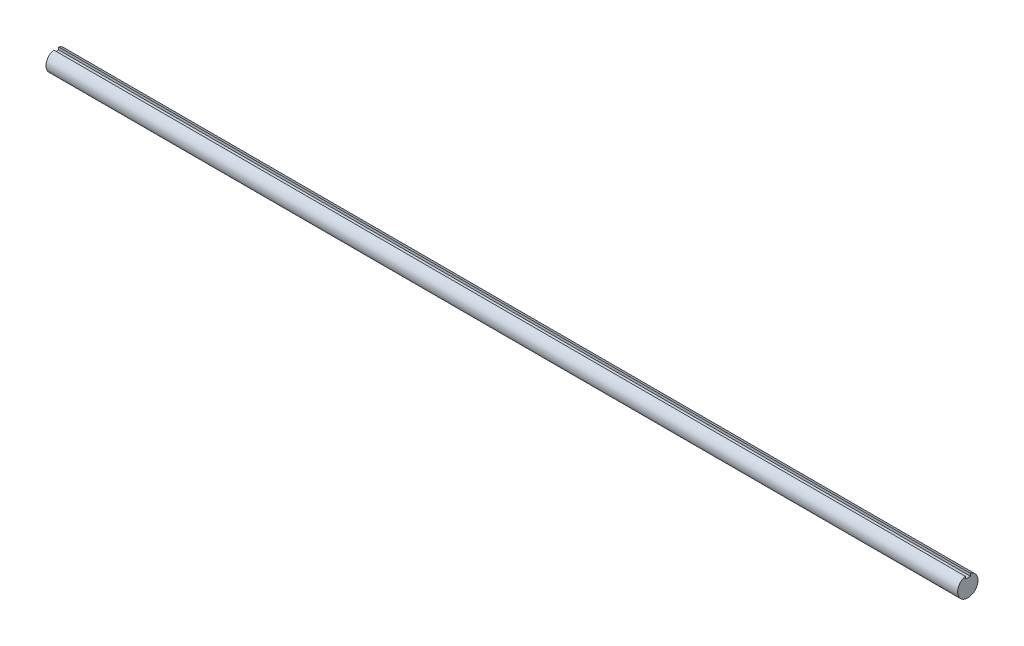
ISO-10303-21;
HEADER;
FILE_DESCRIPTION(('STEP AP214'),'2;1');
FILE_NAME('part.step','',(''),(''),'','','');
FILE_SCHEMA(('AUTOMOTIVE_DESIGN { 1 0 10303 214 1 1 1 1 }'));
ENDSEC;
DATA;
#1=APPLICATION_CONTEXT('core data for automotive mechanical design processes');
#2=APPLICATION_PROTOCOL_DEFINITION('international standard','automotive_design',2000,#1);
#3=PRODUCT_CONTEXT('',#1,'mechanical');
#4=PRODUCT('Part','Part','',(#3));
#5=PRODUCT_RELATED_PRODUCT_CATEGORY('part','',(#4));
#6=PRODUCT_DEFINITION_FORMATION('','',#4);
#7=PRODUCT_DEFINITION_CONTEXT('part definition',#1,'design');
#8=PRODUCT_DEFINITION('design','',#6,#7);
#9=PRODUCT_DEFINITION_SHAPE('','',#8);
#10=(LENGTH_UNIT() NAMED_UNIT(*) SI_UNIT(.MILLI.,.METRE.));
#11=(NAMED_UNIT(*) PLANE_ANGLE_UNIT() SI_UNIT($,.RADIAN.));
#12=(NAMED_UNIT(*) SI_UNIT($,.STERADIAN.) SOLID_ANGLE_UNIT());
#13=UNCERTAINTY_MEASURE_WITH_UNIT(LENGTH_MEASURE(1.E-05),#10,'distance_accuracy_value','');
#14=(GEOMETRIC_REPRESENTATION_CONTEXT(3) GLOBAL_UNCERTAINTY_ASSIGNED_CONTEXT((#13)) GLOBAL_UNIT_ASSIGNED_CONTEXT((#10,
#11,#12)) REPRESENTATION_CONTEXT('',''));
#15=CARTESIAN_POINT('',(0.,0.,0.));
#16=DIRECTION('',(0.,0.,1.));
#17=DIRECTION('',(1.,0.,0.));
#18=AXIS2_PLACEMENT_3D('',#15,#16,#17);
#19=CARTESIAN_POINT('',(284.1625,0.,0.));
#20=DIRECTION('',(-1.,0.,0.));
#21=DIRECTION('',(0.,0.,1.));
#22=AXIS2_PLACEMENT_3D('',#19,#20,#21);
#23=CYLINDRICAL_SURFACE('',#22,6.35);
#24=CARTESIAN_POINT('',(-284.1625,0.,0.));
#25=DIRECTION('',(1.,0.,0.));
#26=DIRECTION('',(0.,0.,-1.));
#27=AXIS2_PLACEMENT_3D('',#24,#25,#26);
#28=CIRCLE('',#27,6.35);
#29=CARTESIAN_POINT('',(-284.1625,6.14836106210428,1.5875));
#30=VERTEX_POINT('',#29);
#31=CARTESIAN_POINT('',(-284.1625,6.14836106210428,-1.5875));
#32=VERTEX_POINT('',#31);
#33=EDGE_CURVE('E96',#30,#32,#28,.T.);
#34=ORIENTED_EDGE('',*,*,#33,.T.);
#35=DIRECTION('',(-1.,0.,0.));
#36=VECTOR('',#35,1.);
#37=CARTESIAN_POINT('',(284.1625,6.14836106210428,-1.5875));
#38=LINE('',#37,#36);
#39=CARTESIAN_POINT('',(284.1625,6.14836106210428,-1.5875));
#40=VERTEX_POINT('',#39);
#41=EDGE_CURVE('E11',#40,#32,#38,.T.);
#42=ORIENTED_EDGE('',*,*,#41,.F.);
#43=CARTESIAN_POINT('',(284.1625,0.,0.));
#44=DIRECTION('',(1.,0.,0.));
#45=DIRECTION('',(0.,0.,-1.));
#46=AXIS2_PLACEMENT_3D('',#43,#44,#45);
#47=CIRCLE('',#46,6.35);
#48=CARTESIAN_POINT('',(284.1625,6.14836106210428,1.5875));
#49=VERTEX_POINT('',#48);
#50=EDGE_CURVE('E84',#49,#40,#47,.T.);
#51=ORIENTED_EDGE('',*,*,#50,.F.);
#52=DIRECTION('',(-1.,0.,0.));
#53=VECTOR('',#52,1.);
#54=CARTESIAN_POINT('',(284.1625,6.14836106210428,1.5875));
#55=LINE('',#54,#53);
#56=EDGE_CURVE('E92',#49,#30,#55,.T.);
#57=ORIENTED_EDGE('',*,*,#56,.T.);
#58=EDGE_LOOP('',(#34,#42,#51,#57));
#59=FACE_BOUND('',#58,.T.);
#60=ADVANCED_FACE('F33',(#59),#23,.T.);
#61=CARTESIAN_POINT('',(284.1625,6.14836106210428,-1.5875));
#62=DIRECTION('',(0.,0.,-1.));
#63=DIRECTION('',(0.,1.,0.));
#64=AXIS2_PLACEMENT_3D('',#61,#62,#63);
#65=PLANE('',#64);
#66=DIRECTION('',(0.,-1.,0.));
#67=VECTOR('',#66,1.);
#68=CARTESIAN_POINT('',(-284.1625,6.14836106210428,-1.5875));
#69=LINE('',#68,#67);
#70=CARTESIAN_POINT('',(-284.1625,4.56086106210427,-1.5875));
#71=VERTEX_POINT('',#70);
#72=EDGE_CURVE('E88',#32,#71,#69,.T.);
#73=ORIENTED_EDGE('',*,*,#72,.T.);
#74=DIRECTION('',(-1.,0.,0.));
#75=VECTOR('',#74,1.);
#76=CARTESIAN_POINT('',(284.1625,4.56086106210427,-1.5875));
#77=LINE('',#76,#75);
#78=CARTESIAN_POINT('',(284.1625,4.56086106210427,-1.5875));
#79=VERTEX_POINT('',#78);
#80=EDGE_CURVE('E41',#79,#71,#77,.T.);
#81=ORIENTED_EDGE('',*,*,#80,.F.);
#82=DIRECTION('',(0.,-1.,0.));
#83=VECTOR('',#82,1.);
#84=CARTESIAN_POINT('',(284.1625,6.14836106210428,-1.5875));
#85=LINE('',#84,#83);
#86=EDGE_CURVE('E79',#40,#79,#85,.T.);
#87=ORIENTED_EDGE('',*,*,#86,.F.);
#88=ORIENTED_EDGE('',*,*,#41,.T.);
#89=EDGE_LOOP('',(#73,#81,#87,#88));
#90=FACE_BOUND('',#89,.T.);
#91=ADVANCED_FACE('F87',(#90),#65,.F.);
#92=CARTESIAN_POINT('',(284.1625,4.56086106210427,1.5875));
#93=DIRECTION('',(0.,-1.,0.));
#94=DIRECTION('',(0.,0.,-1.));
#95=AXIS2_PLACEMENT_3D('',#92,#93,#94);
#96=PLANE('',#95);
#97=DIRECTION('',(0.,0.,1.));
#98=VECTOR('',#97,1.);
#99=CARTESIAN_POINT('',(-284.1625,4.56086106210427,1.5875));
#100=LINE('',#99,#98);
#101=CARTESIAN_POINT('',(-284.1625,4.56086106210427,1.5875));
#102=VERTEX_POINT('',#101);
#103=EDGE_CURVE('E66',#71,#102,#100,.T.);
#104=ORIENTED_EDGE('',*,*,#103,.T.);
#105=DIRECTION('',(-1.,0.,0.));
#106=VECTOR('',#105,1.);
#107=CARTESIAN_POINT('',(284.1625,4.56086106210427,1.5875));
#108=LINE('',#107,#106);
#109=CARTESIAN_POINT('',(284.1625,4.56086106210427,1.5875));
#110=VERTEX_POINT('',#109);
#111=EDGE_CURVE('E89',#110,#102,#108,.T.);
#112=ORIENTED_EDGE('',*,*,#111,.F.);
#113=DIRECTION('',(0.,0.,1.));
#114=VECTOR('',#113,1.);
#115=CARTESIAN_POINT('',(284.1625,4.56086106210427,1.5875));
#116=LINE('',#115,#114);
#117=EDGE_CURVE('E82',#79,#110,#116,.T.);
#118=ORIENTED_EDGE('',*,*,#117,.F.);
#119=ORIENTED_EDGE('',*,*,#80,.T.);
#120=EDGE_LOOP('',(#104,#112,#118,#119));
#121=FACE_BOUND('',#120,.T.);
#122=ADVANCED_FACE('F90',(#121),#96,.F.);
#123=CARTESIAN_POINT('',(284.1625,6.14836106210428,1.5875));
#124=DIRECTION('',(0.,0.,1.));
#125=DIRECTION('',(0.,-1.,0.));
#126=AXIS2_PLACEMENT_3D('',#123,#124,#125);
#127=PLANE('',#126);
#128=DIRECTION('',(0.,1.,0.));
#129=VECTOR('',#128,1.);
#130=CARTESIAN_POINT('',(-284.1625,6.14836106210428,1.5875));
#131=LINE('',#130,#129);
#132=EDGE_CURVE('E72',#102,#30,#131,.T.);
#133=ORIENTED_EDGE('',*,*,#132,.T.);
#134=ORIENTED_EDGE('',*,*,#56,.F.);
#135=DIRECTION('',(0.,1.,0.));
#136=VECTOR('',#135,1.);
#137=CARTESIAN_POINT('',(284.1625,6.14836106210428,1.5875));
#138=LINE('',#137,#136);
#139=EDGE_CURVE('E49',#110,#49,#138,.T.);
#140=ORIENTED_EDGE('',*,*,#139,.F.);
#141=ORIENTED_EDGE('',*,*,#111,.T.);
#142=EDGE_LOOP('',(#133,#134,#140,#141));
#143=FACE_BOUND('',#142,.T.);
#144=ADVANCED_FACE('F103',(#143),#127,.F.);
#145=CARTESIAN_POINT('',(284.1625,0.,0.));
#146=DIRECTION('',(1.,0.,0.));
#147=DIRECTION('',(0.,0.,-1.));
#148=AXIS2_PLACEMENT_3D('',#145,#146,#147);
#149=PLANE('',#148);
#150=ORIENTED_EDGE('',*,*,#50,.T.);
#151=ORIENTED_EDGE('',*,*,#86,.T.);
#152=ORIENTED_EDGE('',*,*,#117,.T.);
#153=ORIENTED_EDGE('',*,*,#139,.T.);
#154=EDGE_LOOP('',(#150,#151,#152,#153));
#155=FACE_BOUND('',#154,.T.);
#156=ADVANCED_FACE('F80',(#155),#149,.T.);
#157=CARTESIAN_POINT('',(-284.1625,0.,0.));
#158=DIRECTION('',(1.,0.,0.));
#159=DIRECTION('',(0.,0.,-1.));
#160=AXIS2_PLACEMENT_3D('',#157,#158,#159);
#161=PLANE('',#160);
#162=ORIENTED_EDGE('',*,*,#33,.F.);
#163=ORIENTED_EDGE('',*,*,#132,.F.);
#164=ORIENTED_EDGE('',*,*,#103,.F.);
#165=ORIENTED_EDGE('',*,*,#72,.F.);
#166=EDGE_LOOP('',(#162,#163,#164,#165));
#167=FACE_BOUND('',#166,.T.);
#168=ADVANCED_FACE('F106',(#167),#161,.F.);
#169=CLOSED_SHELL('',(#60,#91,#122,#144,#156,#168));
#170=MANIFOLD_SOLID_BREP('B2',#169);
#171=ADVANCED_BREP_SHAPE_REPRESENTATION('',(#18,#170),#14);
#172=SHAPE_DEFINITION_REPRESENTATION(#9,#171);
ENDSEC;
END-ISO-10303-21;
